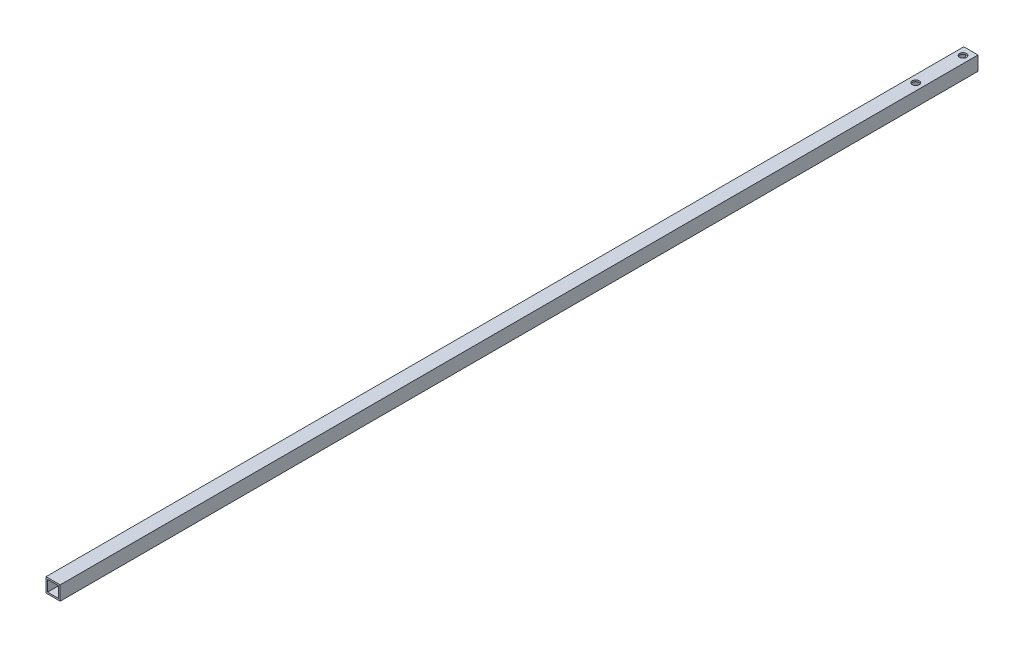
ISO-10303-21;
HEADER;
FILE_DESCRIPTION(('STEP AP214'),'2;1');
FILE_NAME('part.step','',(''),(''),'','','');
FILE_SCHEMA(('AUTOMOTIVE_DESIGN { 1 0 10303 214 1 1 1 1 }'));
ENDSEC;
DATA;
#1=APPLICATION_CONTEXT('core data for automotive mechanical design processes');
#2=APPLICATION_PROTOCOL_DEFINITION('international standard','automotive_design',2000,#1);
#3=PRODUCT_CONTEXT('',#1,'mechanical');
#4=PRODUCT('Part','Part','',(#3));
#5=PRODUCT_RELATED_PRODUCT_CATEGORY('part','',(#4));
#6=PRODUCT_DEFINITION_FORMATION('','',#4);
#7=PRODUCT_DEFINITION_CONTEXT('part definition',#1,'design');
#8=PRODUCT_DEFINITION('design','',#6,#7);
#9=PRODUCT_DEFINITION_SHAPE('','',#8);
#10=(LENGTH_UNIT() NAMED_UNIT(*) SI_UNIT(.MILLI.,.METRE.));
#11=(NAMED_UNIT(*) PLANE_ANGLE_UNIT() SI_UNIT($,.RADIAN.));
#12=(NAMED_UNIT(*) SI_UNIT($,.STERADIAN.) SOLID_ANGLE_UNIT());
#13=UNCERTAINTY_MEASURE_WITH_UNIT(LENGTH_MEASURE(1.E-05),#10,'distance_accuracy_value','');
#14=(GEOMETRIC_REPRESENTATION_CONTEXT(3) GLOBAL_UNCERTAINTY_ASSIGNED_CONTEXT((#13)) GLOBAL_UNIT_ASSIGNED_CONTEXT((#10,
#11,#12)) REPRESENTATION_CONTEXT('',''));
#15=CARTESIAN_POINT('',(0.,0.,0.));
#16=DIRECTION('',(0.,0.,1.));
#17=DIRECTION('',(1.,0.,0.));
#18=AXIS2_PLACEMENT_3D('',#15,#16,#17);
#19=CARTESIAN_POINT('',(4.5,4.5,582.));
#20=DIRECTION('',(-1.,0.,0.));
#21=DIRECTION('',(0.,-1.,0.));
#22=AXIS2_PLACEMENT_3D('',#19,#20,#21);
#23=PLANE('',#22);
#24=DIRECTION('',(0.,1.,0.));
#25=VECTOR('',#24,1.);
#26=CARTESIAN_POINT('',(4.5,4.5,0.));
#27=LINE('',#26,#25);
#28=CARTESIAN_POINT('',(4.5,-4.5,0.));
#29=VERTEX_POINT('',#28);
#30=CARTESIAN_POINT('',(4.5,4.5,0.));
#31=VERTEX_POINT('',#30);
#32=EDGE_CURVE('E139',#29,#31,#27,.T.);
#33=ORIENTED_EDGE('',*,*,#32,.T.);
#34=DIRECTION('',(0.,0.,-1.));
#35=VECTOR('',#34,1.);
#36=CARTESIAN_POINT('',(4.5,4.5,582.));
#37=LINE('',#36,#35);
#38=CARTESIAN_POINT('',(4.5,4.5,582.));
#39=VERTEX_POINT('',#38);
#40=EDGE_CURVE('E11',#39,#31,#37,.T.);
#41=ORIENTED_EDGE('',*,*,#40,.F.);
#42=DIRECTION('',(0.,1.,0.));
#43=VECTOR('',#42,1.);
#44=CARTESIAN_POINT('',(4.5,4.5,582.));
#45=LINE('',#44,#43);
#46=CARTESIAN_POINT('',(4.5,-4.5,582.));
#47=VERTEX_POINT('',#46);
#48=EDGE_CURVE('E143',#47,#39,#45,.T.);
#49=ORIENTED_EDGE('',*,*,#48,.F.);
#50=DIRECTION('',(0.,0.,-1.));
#51=VECTOR('',#50,1.);
#52=CARTESIAN_POINT('',(4.5,-4.5,582.));
#53=LINE('',#52,#51);
#54=EDGE_CURVE('E153',#47,#29,#53,.T.);
#55=ORIENTED_EDGE('',*,*,#54,.T.);
#56=EDGE_LOOP('',(#33,#41,#49,#55));
#57=FACE_BOUND('',#56,.T.);
#58=ADVANCED_FACE('F37',(#57),#23,.F.);
#59=CARTESIAN_POINT('',(-4.5,4.5,582.));
#60=DIRECTION('',(0.,-1.,0.));
#61=DIRECTION('',(0.,0.,-1.));
#62=AXIS2_PLACEMENT_3D('',#59,#60,#61);
#63=PLANE('',#62);
#64=CARTESIAN_POINT('',(0.,4.5,5.));
#65=DIRECTION('',(0.,1.,0.));
#66=DIRECTION('',(0.,0.,1.));
#67=AXIS2_PLACEMENT_3D('',#64,#65,#66);
#68=CIRCLE('',#67,2.2);
#69=CARTESIAN_POINT('',(0.,4.5,7.2));
#70=VERTEX_POINT('',#69);
#71=EDGE_CURVE('E170',#70,#70,#68,.T.);
#72=ORIENTED_EDGE('',*,*,#71,.F.);
#73=EDGE_LOOP('',(#72));
#74=FACE_BOUND('',#73,.T.);
#75=CARTESIAN_POINT('',(0.,4.5,35.));
#76=DIRECTION('',(0.,1.,0.));
#77=DIRECTION('',(0.,0.,1.));
#78=AXIS2_PLACEMENT_3D('',#75,#76,#77);
#79=CIRCLE('',#78,2.2);
#80=CARTESIAN_POINT('',(0.,4.5,37.2));
#81=VERTEX_POINT('',#80);
#82=EDGE_CURVE('E177',#81,#81,#79,.T.);
#83=ORIENTED_EDGE('',*,*,#82,.F.);
#84=EDGE_LOOP('',(#83));
#85=FACE_BOUND('',#84,.T.);
#86=DIRECTION('',(-1.,0.,0.));
#87=VECTOR('',#86,1.);
#88=CARTESIAN_POINT('',(-4.5,4.5,0.));
#89=LINE('',#88,#87);
#90=CARTESIAN_POINT('',(-4.5,4.5,0.));
#91=VERTEX_POINT('',#90);
#92=EDGE_CURVE('E156',#31,#91,#89,.T.);
#93=ORIENTED_EDGE('',*,*,#92,.T.);
#94=DIRECTION('',(0.,0.,-1.));
#95=VECTOR('',#94,1.);
#96=CARTESIAN_POINT('',(-4.5,4.5,582.));
#97=LINE('',#96,#95);
#98=CARTESIAN_POINT('',(-4.5,4.5,582.));
#99=VERTEX_POINT('',#98);
#100=EDGE_CURVE('E45',#99,#91,#97,.T.);
#101=ORIENTED_EDGE('',*,*,#100,.F.);
#102=DIRECTION('',(-1.,0.,0.));
#103=VECTOR('',#102,1.);
#104=CARTESIAN_POINT('',(-4.5,4.5,582.));
#105=LINE('',#104,#103);
#106=EDGE_CURVE('E146',#39,#99,#105,.T.);
#107=ORIENTED_EDGE('',*,*,#106,.F.);
#108=ORIENTED_EDGE('',*,*,#40,.T.);
#109=EDGE_LOOP('',(#93,#101,#107,#108));
#110=FACE_BOUND('',#109,.T.);
#111=ADVANCED_FACE('F210',(#74,#85,#110),#63,.F.);
#112=CARTESIAN_POINT('',(-4.5,4.5,582.));
#113=DIRECTION('',(1.,0.,0.));
#114=DIRECTION('',(0.,1.,0.));
#115=AXIS2_PLACEMENT_3D('',#112,#113,#114);
#116=PLANE('',#115);
#117=DIRECTION('',(0.,-1.,0.));
#118=VECTOR('',#117,1.);
#119=CARTESIAN_POINT('',(-4.5,4.5,0.));
#120=LINE('',#119,#118);
#121=CARTESIAN_POINT('',(-4.5,-4.5,0.));
#122=VERTEX_POINT('',#121);
#123=EDGE_CURVE('E158',#91,#122,#120,.T.);
#124=ORIENTED_EDGE('',*,*,#123,.T.);
#125=DIRECTION('',(0.,0.,-1.));
#126=VECTOR('',#125,1.);
#127=CARTESIAN_POINT('',(-4.5,-4.5,582.));
#128=LINE('',#127,#126);
#129=CARTESIAN_POINT('',(-4.5,-4.5,582.));
#130=VERTEX_POINT('',#129);
#131=EDGE_CURVE('E163',#130,#122,#128,.T.);
#132=ORIENTED_EDGE('',*,*,#131,.F.);
#133=DIRECTION('',(0.,-1.,0.));
#134=VECTOR('',#133,1.);
#135=CARTESIAN_POINT('',(-4.5,4.5,582.));
#136=LINE('',#135,#134);
#137=EDGE_CURVE('E149',#99,#130,#136,.T.);
#138=ORIENTED_EDGE('',*,*,#137,.F.);
#139=ORIENTED_EDGE('',*,*,#100,.T.);
#140=EDGE_LOOP('',(#124,#132,#138,#139));
#141=FACE_BOUND('',#140,.T.);
#142=ADVANCED_FACE('F215',(#141),#116,.F.);
#143=CARTESIAN_POINT('',(-4.5,-4.5,582.));
#144=DIRECTION('',(0.,1.,0.));
#145=DIRECTION('',(0.,0.,1.));
#146=AXIS2_PLACEMENT_3D('',#143,#144,#145);
#147=PLANE('',#146);
#148=CARTESIAN_POINT('',(0.,-4.49999999999995,5.));
#149=DIRECTION('',(0.,1.,0.));
#150=DIRECTION('',(0.,0.,1.));
#151=AXIS2_PLACEMENT_3D('',#148,#149,#150);
#152=CIRCLE('',#151,2.2);
#153=CARTESIAN_POINT('',(0.,-4.49999999999995,7.2));
#154=VERTEX_POINT('',#153);
#155=EDGE_CURVE('E127',#154,#154,#152,.T.);
#156=ORIENTED_EDGE('',*,*,#155,.T.);
#157=EDGE_LOOP('',(#156));
#158=FACE_BOUND('',#157,.T.);
#159=CARTESIAN_POINT('',(0.,-4.49999999999995,35.));
#160=DIRECTION('',(0.,1.,0.));
#161=DIRECTION('',(0.,0.,1.));
#162=AXIS2_PLACEMENT_3D('',#159,#160,#161);
#163=CIRCLE('',#162,2.2);
#164=CARTESIAN_POINT('',(0.,-4.49999999999995,37.2));
#165=VERTEX_POINT('',#164);
#166=EDGE_CURVE('E174',#165,#165,#163,.T.);
#167=ORIENTED_EDGE('',*,*,#166,.T.);
#168=EDGE_LOOP('',(#167));
#169=FACE_BOUND('',#168,.T.);
#170=DIRECTION('',(1.,0.,0.));
#171=VECTOR('',#170,1.);
#172=CARTESIAN_POINT('',(-4.5,-4.5,0.));
#173=LINE('',#172,#171);
#174=EDGE_CURVE('E147',#122,#29,#173,.T.);
#175=ORIENTED_EDGE('',*,*,#174,.T.);
#176=ORIENTED_EDGE('',*,*,#54,.F.);
#177=DIRECTION('',(1.,0.,0.));
#178=VECTOR('',#177,1.);
#179=CARTESIAN_POINT('',(-4.5,-4.5,582.));
#180=LINE('',#179,#178);
#181=EDGE_CURVE('E151',#130,#47,#180,.T.);
#182=ORIENTED_EDGE('',*,*,#181,.F.);
#183=ORIENTED_EDGE('',*,*,#131,.T.);
#184=EDGE_LOOP('',(#175,#176,#182,#183));
#185=FACE_BOUND('',#184,.T.);
#186=ADVANCED_FACE('F231',(#158,#169,#185),#147,.F.);
#187=CARTESIAN_POINT('',(0.,0.,582.));
#188=DIRECTION('',(0.,0.,1.));
#189=DIRECTION('',(1.,0.,0.));
#190=AXIS2_PLACEMENT_3D('',#187,#188,#189);
#191=PLANE('',#190);
#192=DIRECTION('',(0.,1.,0.));
#193=VECTOR('',#192,1.);
#194=CARTESIAN_POINT('',(3.5,3.5,582.));
#195=LINE('',#194,#193);
#196=CARTESIAN_POINT('',(3.5,-3.5,582.));
#197=VERTEX_POINT('',#196);
#198=CARTESIAN_POINT('',(3.5,3.5,582.));
#199=VERTEX_POINT('',#198);
#200=EDGE_CURVE('E53',#197,#199,#195,.T.);
#201=ORIENTED_EDGE('',*,*,#200,.F.);
#202=DIRECTION('',(1.,0.,0.));
#203=VECTOR('',#202,1.);
#204=CARTESIAN_POINT('',(-3.5,-3.5,582.));
#205=LINE('',#204,#203);
#206=CARTESIAN_POINT('',(-3.5,-3.5,582.));
#207=VERTEX_POINT('',#206);
#208=EDGE_CURVE('E121',#207,#197,#205,.T.);
#209=ORIENTED_EDGE('',*,*,#208,.F.);
#210=DIRECTION('',(0.,-1.,0.));
#211=VECTOR('',#210,1.);
#212=CARTESIAN_POINT('',(-3.5,3.5,582.));
#213=LINE('',#212,#211);
#214=CARTESIAN_POINT('',(-3.5,3.5,582.));
#215=VERTEX_POINT('',#214);
#216=EDGE_CURVE('E124',#215,#207,#213,.T.);
#217=ORIENTED_EDGE('',*,*,#216,.F.);
#218=DIRECTION('',(-1.,0.,0.));
#219=VECTOR('',#218,1.);
#220=CARTESIAN_POINT('',(-3.5,3.5,582.));
#221=LINE('',#220,#219);
#222=EDGE_CURVE('E133',#199,#215,#221,.T.);
#223=ORIENTED_EDGE('',*,*,#222,.F.);
#224=EDGE_LOOP('',(#201,#209,#217,#223));
#225=FACE_BOUND('',#224,.T.);
#226=ORIENTED_EDGE('',*,*,#48,.T.);
#227=ORIENTED_EDGE('',*,*,#106,.T.);
#228=ORIENTED_EDGE('',*,*,#137,.T.);
#229=ORIENTED_EDGE('',*,*,#181,.T.);
#230=EDGE_LOOP('',(#226,#227,#228,#229));
#231=FACE_BOUND('',#230,.T.);
#232=ADVANCED_FACE('F227',(#225,#231),#191,.T.);
#233=CARTESIAN_POINT('',(0.,0.,0.));
#234=DIRECTION('',(0.,0.,1.));
#235=DIRECTION('',(1.,0.,0.));
#236=AXIS2_PLACEMENT_3D('',#233,#234,#235);
#237=PLANE('',#236);
#238=DIRECTION('',(1.,0.,0.));
#239=VECTOR('',#238,1.);
#240=CARTESIAN_POINT('',(-3.5,-3.5,0.));
#241=LINE('',#240,#239);
#242=CARTESIAN_POINT('',(-3.5,-3.5,0.));
#243=VERTEX_POINT('',#242);
#244=CARTESIAN_POINT('',(3.5,-3.5,0.));
#245=VERTEX_POINT('',#244);
#246=EDGE_CURVE('E111',#243,#245,#241,.T.);
#247=ORIENTED_EDGE('',*,*,#246,.T.);
#248=DIRECTION('',(0.,1.,0.));
#249=VECTOR('',#248,1.);
#250=CARTESIAN_POINT('',(3.5,3.5,0.));
#251=LINE('',#250,#249);
#252=CARTESIAN_POINT('',(3.5,3.5,0.));
#253=VERTEX_POINT('',#252);
#254=EDGE_CURVE('E105',#245,#253,#251,.T.);
#255=ORIENTED_EDGE('',*,*,#254,.T.);
#256=DIRECTION('',(-1.,0.,0.));
#257=VECTOR('',#256,1.);
#258=CARTESIAN_POINT('',(-3.5,3.5,0.));
#259=LINE('',#258,#257);
#260=CARTESIAN_POINT('',(-3.5,3.5,0.));
#261=VERTEX_POINT('',#260);
#262=EDGE_CURVE('E114',#253,#261,#259,.T.);
#263=ORIENTED_EDGE('',*,*,#262,.T.);
#264=DIRECTION('',(0.,-1.,0.));
#265=VECTOR('',#264,1.);
#266=CARTESIAN_POINT('',(-3.5,3.5,0.));
#267=LINE('',#266,#265);
#268=EDGE_CURVE('E61',#261,#243,#267,.T.);
#269=ORIENTED_EDGE('',*,*,#268,.T.);
#270=EDGE_LOOP('',(#247,#255,#263,#269));
#271=FACE_BOUND('',#270,.T.);
#272=ORIENTED_EDGE('',*,*,#32,.F.);
#273=ORIENTED_EDGE('',*,*,#174,.F.);
#274=ORIENTED_EDGE('',*,*,#123,.F.);
#275=ORIENTED_EDGE('',*,*,#92,.F.);
#276=EDGE_LOOP('',(#272,#273,#274,#275));
#277=FACE_BOUND('',#276,.T.);
#278=ADVANCED_FACE('F118',(#271,#277),#237,.F.);
#279=CARTESIAN_POINT('',(3.5,3.5,0.));
#280=DIRECTION('',(1.,0.,0.));
#281=DIRECTION('',(0.,1.,0.));
#282=AXIS2_PLACEMENT_3D('',#279,#280,#281);
#283=PLANE('',#282);
#284=ORIENTED_EDGE('',*,*,#200,.T.);
#285=DIRECTION('',(0.,0.,1.));
#286=VECTOR('',#285,1.);
#287=CARTESIAN_POINT('',(3.5,3.5,0.));
#288=LINE('',#287,#286);
#289=EDGE_CURVE('E101',#253,#199,#288,.T.);
#290=ORIENTED_EDGE('',*,*,#289,.F.);
#291=ORIENTED_EDGE('',*,*,#254,.F.);
#292=DIRECTION('',(0.,0.,1.));
#293=VECTOR('',#292,1.);
#294=CARTESIAN_POINT('',(3.5,-3.5,0.));
#295=LINE('',#294,#293);
#296=EDGE_CURVE('E137',#245,#197,#295,.T.);
#297=ORIENTED_EDGE('',*,*,#296,.T.);
#298=EDGE_LOOP('',(#284,#290,#291,#297));
#299=FACE_BOUND('',#298,.T.);
#300=ADVANCED_FACE('F103',(#299),#283,.F.);
#301=CARTESIAN_POINT('',(-3.5,-3.5,0.));
#302=DIRECTION('',(0.,-1.,0.));
#303=DIRECTION('',(0.,0.,-1.));
#304=AXIS2_PLACEMENT_3D('',#301,#302,#303);
#305=PLANE('',#304);
#306=CARTESIAN_POINT('',(0.,-3.49999999999995,5.));
#307=DIRECTION('',(0.,-1.,0.));
#308=DIRECTION('',(0.,0.,-1.));
#309=AXIS2_PLACEMENT_3D('',#306,#307,#308);
#310=CIRCLE('',#309,2.2);
#311=CARTESIAN_POINT('',(0.,-3.49999999999995,2.8));
#312=VERTEX_POINT('',#311);
#313=EDGE_CURVE('E185',#312,#312,#310,.T.);
#314=ORIENTED_EDGE('',*,*,#313,.T.);
#315=EDGE_LOOP('',(#314));
#316=FACE_BOUND('',#315,.T.);
#317=CARTESIAN_POINT('',(0.,-3.49999999999995,35.));
#318=DIRECTION('',(0.,-1.,0.));
#319=DIRECTION('',(0.,0.,-1.));
#320=AXIS2_PLACEMENT_3D('',#317,#318,#319);
#321=CIRCLE('',#320,2.2);
#322=CARTESIAN_POINT('',(0.,-3.49999999999995,32.8));
#323=VERTEX_POINT('',#322);
#324=EDGE_CURVE('E169',#323,#323,#321,.T.);
#325=ORIENTED_EDGE('',*,*,#324,.T.);
#326=EDGE_LOOP('',(#325));
#327=FACE_BOUND('',#326,.T.);
#328=ORIENTED_EDGE('',*,*,#208,.T.);
#329=ORIENTED_EDGE('',*,*,#296,.F.);
#330=ORIENTED_EDGE('',*,*,#246,.F.);
#331=DIRECTION('',(0.,0.,1.));
#332=VECTOR('',#331,1.);
#333=CARTESIAN_POINT('',(-3.5,-3.5,0.));
#334=LINE('',#333,#332);
#335=EDGE_CURVE('E140',#243,#207,#334,.T.);
#336=ORIENTED_EDGE('',*,*,#335,.T.);
#337=EDGE_LOOP('',(#328,#329,#330,#336));
#338=FACE_BOUND('',#337,.T.);
#339=ADVANCED_FACE('F248',(#316,#327,#338),#305,.F.);
#340=CARTESIAN_POINT('',(-3.5,3.5,0.));
#341=DIRECTION('',(-1.,0.,0.));
#342=DIRECTION('',(0.,-1.,0.));
#343=AXIS2_PLACEMENT_3D('',#340,#341,#342);
#344=PLANE('',#343);
#345=ORIENTED_EDGE('',*,*,#216,.T.);
#346=ORIENTED_EDGE('',*,*,#335,.F.);
#347=ORIENTED_EDGE('',*,*,#268,.F.);
#348=DIRECTION('',(0.,0.,1.));
#349=VECTOR('',#348,1.);
#350=CARTESIAN_POINT('',(-3.5,3.5,0.));
#351=LINE('',#350,#349);
#352=EDGE_CURVE('E110',#261,#215,#351,.T.);
#353=ORIENTED_EDGE('',*,*,#352,.T.);
#354=EDGE_LOOP('',(#345,#346,#347,#353));
#355=FACE_BOUND('',#354,.T.);
#356=ADVANCED_FACE('F251',(#355),#344,.F.);
#357=CARTESIAN_POINT('',(-3.5,3.5,0.));
#358=DIRECTION('',(0.,1.,0.));
#359=DIRECTION('',(0.,0.,1.));
#360=AXIS2_PLACEMENT_3D('',#357,#358,#359);
#361=PLANE('',#360);
#362=CARTESIAN_POINT('',(0.,3.49999999999995,5.));
#363=DIRECTION('',(0.,1.,0.));
#364=DIRECTION('',(0.,0.,1.));
#365=AXIS2_PLACEMENT_3D('',#362,#363,#364);
#366=CIRCLE('',#365,2.2);
#367=CARTESIAN_POINT('',(0.,3.49999999999995,7.2));
#368=VERTEX_POINT('',#367);
#369=EDGE_CURVE('E40',#368,#368,#366,.T.);
#370=ORIENTED_EDGE('',*,*,#369,.T.);
#371=EDGE_LOOP('',(#370));
#372=FACE_BOUND('',#371,.T.);
#373=CARTESIAN_POINT('',(0.,3.49999999999995,35.));
#374=DIRECTION('',(0.,1.,0.));
#375=DIRECTION('',(0.,0.,1.));
#376=AXIS2_PLACEMENT_3D('',#373,#374,#375);
#377=CIRCLE('',#376,2.2);
#378=CARTESIAN_POINT('',(0.,3.49999999999995,37.2));
#379=VERTEX_POINT('',#378);
#380=EDGE_CURVE('E167',#379,#379,#377,.T.);
#381=ORIENTED_EDGE('',*,*,#380,.T.);
#382=EDGE_LOOP('',(#381));
#383=FACE_BOUND('',#382,.T.);
#384=ORIENTED_EDGE('',*,*,#222,.T.);
#385=ORIENTED_EDGE('',*,*,#352,.F.);
#386=ORIENTED_EDGE('',*,*,#262,.F.);
#387=ORIENTED_EDGE('',*,*,#289,.T.);
#388=EDGE_LOOP('',(#384,#385,#386,#387));
#389=FACE_BOUND('',#388,.T.);
#390=ADVANCED_FACE('F115',(#372,#383,#389),#361,.F.);
#391=CARTESIAN_POINT('',(0.,-577.5,35.));
#392=DIRECTION('',(0.,1.,0.));
#393=DIRECTION('',(0.,0.,1.));
#394=AXIS2_PLACEMENT_3D('',#391,#392,#393);
#395=CYLINDRICAL_SURFACE('',#394,2.2);
#396=ORIENTED_EDGE('',*,*,#82,.T.);
#397=EDGE_LOOP('',(#396));
#398=FACE_BOUND('',#397,.T.);
#399=ORIENTED_EDGE('',*,*,#380,.F.);
#400=EDGE_LOOP('',(#399));
#401=FACE_BOUND('',#400,.T.);
#402=ADVANCED_FACE('F197',(#398,#401),#395,.F.);
#403=CARTESIAN_POINT('',(0.,-577.5,5.));
#404=DIRECTION('',(0.,1.,0.));
#405=DIRECTION('',(0.,0.,1.));
#406=AXIS2_PLACEMENT_3D('',#403,#404,#405);
#407=CYLINDRICAL_SURFACE('',#406,2.2);
#408=ORIENTED_EDGE('',*,*,#71,.T.);
#409=EDGE_LOOP('',(#408));
#410=FACE_BOUND('',#409,.T.);
#411=ORIENTED_EDGE('',*,*,#369,.F.);
#412=EDGE_LOOP('',(#411));
#413=FACE_BOUND('',#412,.T.);
#414=ADVANCED_FACE('F194',(#410,#413),#407,.F.);
#415=ORIENTED_EDGE('',*,*,#324,.F.);
#416=EDGE_LOOP('',(#415));
#417=FACE_BOUND('',#416,.T.);
#418=ORIENTED_EDGE('',*,*,#166,.F.);
#419=EDGE_LOOP('',(#418));
#420=FACE_BOUND('',#419,.T.);
#421=ADVANCED_FACE('F196',(#417,#420),#395,.F.);
#422=ORIENTED_EDGE('',*,*,#313,.F.);
#423=EDGE_LOOP('',(#422));
#424=FACE_BOUND('',#423,.T.);
#425=ORIENTED_EDGE('',*,*,#155,.F.);
#426=EDGE_LOOP('',(#425));
#427=FACE_BOUND('',#426,.T.);
#428=ADVANCED_FACE('F199',(#424,#427),#407,.F.);
#429=CLOSED_SHELL('',(#58,#111,#142,#186,#232,#278,#300,#339,#356,#390,#402,#414,#421,#428));
#430=MANIFOLD_SOLID_BREP('B2',#429);
#431=ADVANCED_BREP_SHAPE_REPRESENTATION('',(#18,#430),#14);
#432=SHAPE_DEFINITION_REPRESENTATION(#9,#431);
ENDSEC;
END-ISO-10303-21;
